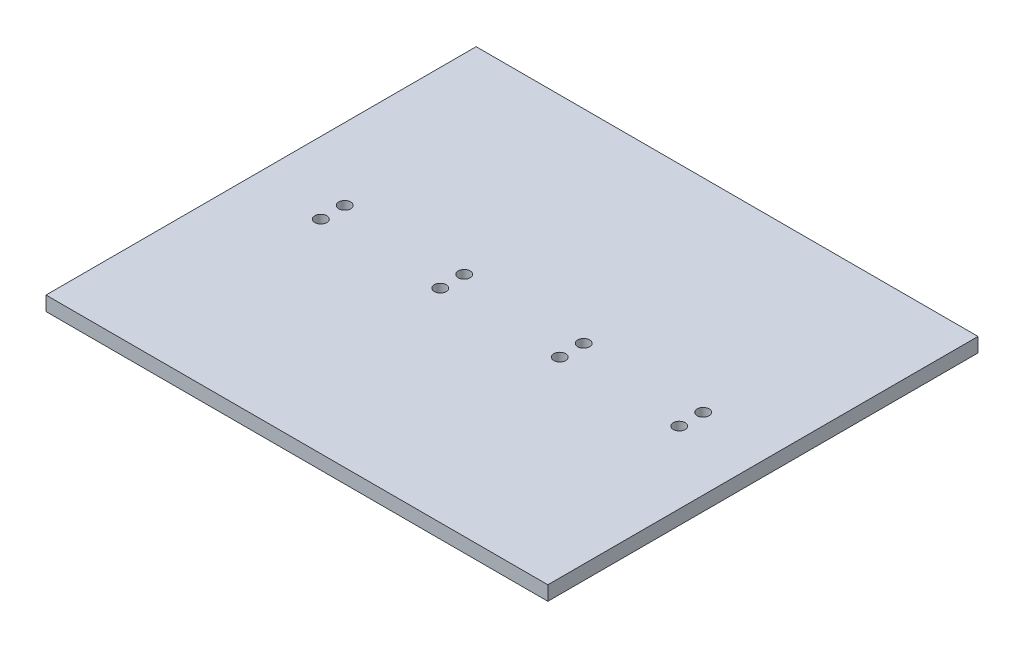
ISO-10303-21;
HEADER;
FILE_DESCRIPTION(('STEP AP214'),'2;1');
FILE_NAME('part.step','',(''),(''),'','','');
FILE_SCHEMA(('AUTOMOTIVE_DESIGN { 1 0 10303 214 1 1 1 1 }'));
ENDSEC;
DATA;
#1=APPLICATION_CONTEXT('core data for automotive mechanical design processes');
#2=APPLICATION_PROTOCOL_DEFINITION('international standard','automotive_design',2000,#1);
#3=PRODUCT_CONTEXT('',#1,'mechanical');
#4=PRODUCT('Part','Part','',(#3));
#5=PRODUCT_RELATED_PRODUCT_CATEGORY('part','',(#4));
#6=PRODUCT_DEFINITION_FORMATION('','',#4);
#7=PRODUCT_DEFINITION_CONTEXT('part definition',#1,'design');
#8=PRODUCT_DEFINITION('design','',#6,#7);
#9=PRODUCT_DEFINITION_SHAPE('','',#8);
#10=(LENGTH_UNIT() NAMED_UNIT(*) SI_UNIT(.MILLI.,.METRE.));
#11=(NAMED_UNIT(*) PLANE_ANGLE_UNIT() SI_UNIT($,.RADIAN.));
#12=(NAMED_UNIT(*) SI_UNIT($,.STERADIAN.) SOLID_ANGLE_UNIT());
#13=UNCERTAINTY_MEASURE_WITH_UNIT(LENGTH_MEASURE(1.E-05),#10,'distance_accuracy_value','');
#14=(GEOMETRIC_REPRESENTATION_CONTEXT(3) GLOBAL_UNCERTAINTY_ASSIGNED_CONTEXT((#13)) GLOBAL_UNIT_ASSIGNED_CONTEXT((#10,
#11,#12)) REPRESENTATION_CONTEXT('',''));
#15=CARTESIAN_POINT('',(0.,0.,0.));
#16=DIRECTION('',(0.,0.,1.));
#17=DIRECTION('',(1.,0.,0.));
#18=AXIS2_PLACEMENT_3D('',#15,#16,#17);
#19=CARTESIAN_POINT('',(5.25,0.3,4.5));
#20=DIRECTION('',(-1.,0.,0.));
#21=DIRECTION('',(0.,0.,1.));
#22=AXIS2_PLACEMENT_3D('',#19,#20,#21);
#23=PLANE('',#22);
#24=DIRECTION('',(0.,0.,-1.));
#25=VECTOR('',#24,1.);
#26=CARTESIAN_POINT('',(5.25,0.,4.5));
#27=LINE('',#26,#25);
#28=CARTESIAN_POINT('',(5.25,0.,4.5));
#29=VERTEX_POINT('',#28);
#30=CARTESIAN_POINT('',(5.25,0.,-4.5));
#31=VERTEX_POINT('',#30);
#32=EDGE_CURVE('E96',#29,#31,#27,.T.);
#33=ORIENTED_EDGE('',*,*,#32,.T.);
#34=DIRECTION('',(0.,-1.,0.));
#35=VECTOR('',#34,1.);
#36=CARTESIAN_POINT('',(5.25,0.3,-4.5));
#37=LINE('',#36,#35);
#38=CARTESIAN_POINT('',(5.25,0.3,-4.5));
#39=VERTEX_POINT('',#38);
#40=EDGE_CURVE('E11',#39,#31,#37,.T.);
#41=ORIENTED_EDGE('',*,*,#40,.F.);
#42=DIRECTION('',(0.,0.,-1.));
#43=VECTOR('',#42,1.);
#44=CARTESIAN_POINT('',(5.25,0.3,4.5));
#45=LINE('',#44,#43);
#46=CARTESIAN_POINT('',(5.25,0.3,4.5));
#47=VERTEX_POINT('',#46);
#48=EDGE_CURVE('E84',#47,#39,#45,.T.);
#49=ORIENTED_EDGE('',*,*,#48,.F.);
#50=DIRECTION('',(0.,-1.,0.));
#51=VECTOR('',#50,1.);
#52=CARTESIAN_POINT('',(5.25,0.3,4.5));
#53=LINE('',#52,#51);
#54=EDGE_CURVE('E92',#47,#29,#53,.T.);
#55=ORIENTED_EDGE('',*,*,#54,.T.);
#56=EDGE_LOOP('',(#33,#41,#49,#55));
#57=FACE_BOUND('',#56,.T.);
#58=ADVANCED_FACE('F33',(#57),#23,.F.);
#59=CARTESIAN_POINT('',(-5.25,0.3,-4.5));
#60=DIRECTION('',(0.,0.,1.));
#61=DIRECTION('',(1.,0.,0.));
#62=AXIS2_PLACEMENT_3D('',#59,#60,#61);
#63=PLANE('',#62);
#64=DIRECTION('',(-1.,0.,0.));
#65=VECTOR('',#64,1.);
#66=CARTESIAN_POINT('',(-5.25,0.,-4.5));
#67=LINE('',#66,#65);
#68=CARTESIAN_POINT('',(-5.25,0.,-4.5));
#69=VERTEX_POINT('',#68);
#70=EDGE_CURVE('E88',#31,#69,#67,.T.);
#71=ORIENTED_EDGE('',*,*,#70,.T.);
#72=DIRECTION('',(0.,-1.,0.));
#73=VECTOR('',#72,1.);
#74=CARTESIAN_POINT('',(-5.25,0.3,-4.5));
#75=LINE('',#74,#73);
#76=CARTESIAN_POINT('',(-5.25,0.3,-4.5));
#77=VERTEX_POINT('',#76);
#78=EDGE_CURVE('E41',#77,#69,#75,.T.);
#79=ORIENTED_EDGE('',*,*,#78,.F.);
#80=DIRECTION('',(-1.,0.,0.));
#81=VECTOR('',#80,1.);
#82=CARTESIAN_POINT('',(-5.25,0.3,-4.5));
#83=LINE('',#82,#81);
#84=EDGE_CURVE('E79',#39,#77,#83,.T.);
#85=ORIENTED_EDGE('',*,*,#84,.F.);
#86=ORIENTED_EDGE('',*,*,#40,.T.);
#87=EDGE_LOOP('',(#71,#79,#85,#86));
#88=FACE_BOUND('',#87,.T.);
#89=ADVANCED_FACE('F87',(#88),#63,.F.);
#90=CARTESIAN_POINT('',(-5.25,0.3,4.5));
#91=DIRECTION('',(1.,0.,0.));
#92=DIRECTION('',(0.,0.,-1.));
#93=AXIS2_PLACEMENT_3D('',#90,#91,#92);
#94=PLANE('',#93);
#95=DIRECTION('',(0.,0.,1.));
#96=VECTOR('',#95,1.);
#97=CARTESIAN_POINT('',(-5.25,0.,4.5));
#98=LINE('',#97,#96);
#99=CARTESIAN_POINT('',(-5.25,0.,4.5));
#100=VERTEX_POINT('',#99);
#101=EDGE_CURVE('E66',#69,#100,#98,.T.);
#102=ORIENTED_EDGE('',*,*,#101,.T.);
#103=DIRECTION('',(0.,-1.,0.));
#104=VECTOR('',#103,1.);
#105=CARTESIAN_POINT('',(-5.25,0.3,4.5));
#106=LINE('',#105,#104);
#107=CARTESIAN_POINT('',(-5.25,0.3,4.5));
#108=VERTEX_POINT('',#107);
#109=EDGE_CURVE('E89',#108,#100,#106,.T.);
#110=ORIENTED_EDGE('',*,*,#109,.F.);
#111=DIRECTION('',(0.,0.,1.));
#112=VECTOR('',#111,1.);
#113=CARTESIAN_POINT('',(-5.25,0.3,4.5));
#114=LINE('',#113,#112);
#115=EDGE_CURVE('E82',#77,#108,#114,.T.);
#116=ORIENTED_EDGE('',*,*,#115,.F.);
#117=ORIENTED_EDGE('',*,*,#78,.T.);
#118=EDGE_LOOP('',(#102,#110,#116,#117));
#119=FACE_BOUND('',#118,.T.);
#120=ADVANCED_FACE('F90',(#119),#94,.F.);
#121=CARTESIAN_POINT('',(-5.25,0.3,4.5));
#122=DIRECTION('',(0.,0.,-1.));
#123=DIRECTION('',(-1.,0.,0.));
#124=AXIS2_PLACEMENT_3D('',#121,#122,#123);
#125=PLANE('',#124);
#126=DIRECTION('',(1.,0.,0.));
#127=VECTOR('',#126,1.);
#128=CARTESIAN_POINT('',(-5.25,0.,4.5));
#129=LINE('',#128,#127);
#130=EDGE_CURVE('E72',#100,#29,#129,.T.);
#131=ORIENTED_EDGE('',*,*,#130,.T.);
#132=ORIENTED_EDGE('',*,*,#54,.F.);
#133=DIRECTION('',(1.,0.,0.));
#134=VECTOR('',#133,1.);
#135=CARTESIAN_POINT('',(-5.25,0.3,4.5));
#136=LINE('',#135,#134);
#137=EDGE_CURVE('E49',#108,#47,#136,.T.);
#138=ORIENTED_EDGE('',*,*,#137,.F.);
#139=ORIENTED_EDGE('',*,*,#109,.T.);
#140=EDGE_LOOP('',(#131,#132,#138,#139));
#141=FACE_BOUND('',#140,.T.);
#142=ADVANCED_FACE('F104',(#141),#125,.F.);
#143=CARTESIAN_POINT('',(0.,0.3,0.));
#144=DIRECTION('',(0.,-1.,0.));
#145=DIRECTION('',(0.,0.,-1.));
#146=AXIS2_PLACEMENT_3D('',#143,#144,#145);
#147=PLANE('',#146);
#148=CARTESIAN_POINT('',(-1.24999999999999,0.3,0.25));
#149=DIRECTION('',(0.,1.,0.));
#150=DIRECTION('',(0.,0.,1.));
#151=AXIS2_PLACEMENT_3D('',#148,#149,#150);
#152=CIRCLE('',#151,0.125);
#153=CARTESIAN_POINT('',(-1.24999999999999,0.3,0.375));
#154=VERTEX_POINT('',#153);
#155=EDGE_CURVE('E128',#154,#154,#152,.T.);
#156=ORIENTED_EDGE('',*,*,#155,.F.);
#157=EDGE_LOOP('',(#156));
#158=FACE_BOUND('',#157,.T.);
#159=CARTESIAN_POINT('',(3.75,0.3,-0.25));
#160=DIRECTION('',(0.,1.,0.));
#161=DIRECTION('',(0.,0.,1.));
#162=AXIS2_PLACEMENT_3D('',#159,#160,#161);
#163=CIRCLE('',#162,0.125000000000001);
#164=CARTESIAN_POINT('',(3.75,0.3,-0.124999999999999));
#165=VERTEX_POINT('',#164);
#166=EDGE_CURVE('E135',#165,#165,#163,.T.);
#167=ORIENTED_EDGE('',*,*,#166,.F.);
#168=EDGE_LOOP('',(#167));
#169=FACE_BOUND('',#168,.T.);
#170=CARTESIAN_POINT('',(1.25,0.3,-0.25));
#171=DIRECTION('',(0.,1.,0.));
#172=DIRECTION('',(0.,0.,1.));
#173=AXIS2_PLACEMENT_3D('',#170,#171,#172);
#174=CIRCLE('',#173,0.125000000000001);
#175=CARTESIAN_POINT('',(1.25,0.3,-0.124999999999999));
#176=VERTEX_POINT('',#175);
#177=EDGE_CURVE('E116',#176,#176,#174,.T.);
#178=ORIENTED_EDGE('',*,*,#177,.F.);
#179=EDGE_LOOP('',(#178));
#180=FACE_BOUND('',#179,.T.);
#181=CARTESIAN_POINT('',(-1.25,0.3,-0.25));
#182=DIRECTION('',(0.,1.,0.));
#183=DIRECTION('',(0.,0.,1.));
#184=AXIS2_PLACEMENT_3D('',#181,#182,#183);
#185=CIRCLE('',#184,0.125);
#186=CARTESIAN_POINT('',(-1.25,0.3,-0.125));
#187=VERTEX_POINT('',#186);
#188=EDGE_CURVE('E123',#187,#187,#185,.T.);
#189=ORIENTED_EDGE('',*,*,#188,.F.);
#190=EDGE_LOOP('',(#189));
#191=FACE_BOUND('',#190,.T.);
#192=CARTESIAN_POINT('',(1.25000000000001,0.3,0.25));
#193=DIRECTION('',(0.,1.,0.));
#194=DIRECTION('',(0.,0.,1.));
#195=AXIS2_PLACEMENT_3D('',#192,#193,#194);
#196=CIRCLE('',#195,0.125000000000001);
#197=CARTESIAN_POINT('',(1.25000000000001,0.3,0.375000000000001));
#198=VERTEX_POINT('',#197);
#199=EDGE_CURVE('E152',#198,#198,#196,.T.);
#200=ORIENTED_EDGE('',*,*,#199,.F.);
#201=EDGE_LOOP('',(#200));
#202=FACE_BOUND('',#201,.T.);
#203=CARTESIAN_POINT('',(3.75,0.3,0.25));
#204=DIRECTION('',(0.,1.,0.));
#205=DIRECTION('',(0.,0.,1.));
#206=AXIS2_PLACEMENT_3D('',#203,#204,#205);
#207=CIRCLE('',#206,0.125000000000001);
#208=CARTESIAN_POINT('',(3.75,0.3,0.375000000000001));
#209=VERTEX_POINT('',#208);
#210=EDGE_CURVE('E146',#209,#209,#207,.T.);
#211=ORIENTED_EDGE('',*,*,#210,.F.);
#212=EDGE_LOOP('',(#211));
#213=FACE_BOUND('',#212,.T.);
#214=CARTESIAN_POINT('',(-3.74999999999999,0.3,0.25));
#215=DIRECTION('',(0.,1.,0.));
#216=DIRECTION('',(0.,0.,1.));
#217=AXIS2_PLACEMENT_3D('',#214,#215,#216);
#218=CIRCLE('',#217,0.125);
#219=CARTESIAN_POINT('',(-3.74999999999999,0.3,0.375));
#220=VERTEX_POINT('',#219);
#221=EDGE_CURVE('E140',#220,#220,#218,.T.);
#222=ORIENTED_EDGE('',*,*,#221,.F.);
#223=EDGE_LOOP('',(#222));
#224=FACE_BOUND('',#223,.T.);
#225=CARTESIAN_POINT('',(-3.75,0.3,-0.25));
#226=DIRECTION('',(0.,1.,0.));
#227=DIRECTION('',(0.,0.,1.));
#228=AXIS2_PLACEMENT_3D('',#225,#226,#227);
#229=CIRCLE('',#228,0.125);
#230=CARTESIAN_POINT('',(-3.75,0.3,-0.125));
#231=VERTEX_POINT('',#230);
#232=EDGE_CURVE('E110',#231,#231,#229,.T.);
#233=ORIENTED_EDGE('',*,*,#232,.F.);
#234=EDGE_LOOP('',(#233));
#235=FACE_BOUND('',#234,.T.);
#236=ORIENTED_EDGE('',*,*,#48,.T.);
#237=ORIENTED_EDGE('',*,*,#84,.T.);
#238=ORIENTED_EDGE('',*,*,#115,.T.);
#239=ORIENTED_EDGE('',*,*,#137,.T.);
#240=EDGE_LOOP('',(#236,#237,#238,#239));
#241=FACE_BOUND('',#240,.T.);
#242=ADVANCED_FACE('F80',(#158,#169,#180,#191,#202,#213,#224,#235,#241),#147,.F.);
#243=CARTESIAN_POINT('',(0.,0.,0.));
#244=DIRECTION('',(0.,-1.,0.));
#245=DIRECTION('',(0.,0.,-1.));
#246=AXIS2_PLACEMENT_3D('',#243,#244,#245);
#247=PLANE('',#246);
#248=CARTESIAN_POINT('',(-1.24999999999999,0.,0.25));
#249=DIRECTION('',(0.,1.,0.));
#250=DIRECTION('',(0.,0.,1.));
#251=AXIS2_PLACEMENT_3D('',#248,#249,#250);
#252=CIRCLE('',#251,0.125);
#253=CARTESIAN_POINT('',(-1.24999999999999,0.,0.375));
#254=VERTEX_POINT('',#253);
#255=EDGE_CURVE('E131',#254,#254,#252,.T.);
#256=ORIENTED_EDGE('',*,*,#255,.T.);
#257=EDGE_LOOP('',(#256));
#258=FACE_BOUND('',#257,.T.);
#259=CARTESIAN_POINT('',(3.75,0.,-0.25));
#260=DIRECTION('',(0.,1.,0.));
#261=DIRECTION('',(0.,0.,1.));
#262=AXIS2_PLACEMENT_3D('',#259,#260,#261);
#263=CIRCLE('',#262,0.125000000000001);
#264=CARTESIAN_POINT('',(3.75,0.,-0.124999999999999));
#265=VERTEX_POINT('',#264);
#266=EDGE_CURVE('E120',#265,#265,#263,.T.);
#267=ORIENTED_EDGE('',*,*,#266,.T.);
#268=EDGE_LOOP('',(#267));
#269=FACE_BOUND('',#268,.T.);
#270=CARTESIAN_POINT('',(1.25,0.,-0.25));
#271=DIRECTION('',(0.,1.,0.));
#272=DIRECTION('',(0.,0.,1.));
#273=AXIS2_PLACEMENT_3D('',#270,#271,#272);
#274=CIRCLE('',#273,0.125000000000001);
#275=CARTESIAN_POINT('',(1.25,0.,-0.124999999999999));
#276=VERTEX_POINT('',#275);
#277=EDGE_CURVE('E119',#276,#276,#274,.T.);
#278=ORIENTED_EDGE('',*,*,#277,.T.);
#279=EDGE_LOOP('',(#278));
#280=FACE_BOUND('',#279,.T.);
#281=CARTESIAN_POINT('',(-1.25,0.,-0.25));
#282=DIRECTION('',(0.,1.,0.));
#283=DIRECTION('',(0.,0.,1.));
#284=AXIS2_PLACEMENT_3D('',#281,#282,#283);
#285=CIRCLE('',#284,0.125);
#286=CARTESIAN_POINT('',(-1.25,0.,-0.125));
#287=VERTEX_POINT('',#286);
#288=EDGE_CURVE('E113',#287,#287,#285,.T.);
#289=ORIENTED_EDGE('',*,*,#288,.T.);
#290=EDGE_LOOP('',(#289));
#291=FACE_BOUND('',#290,.T.);
#292=CARTESIAN_POINT('',(1.25000000000001,0.,0.25));
#293=DIRECTION('',(0.,1.,0.));
#294=DIRECTION('',(0.,0.,1.));
#295=AXIS2_PLACEMENT_3D('',#292,#293,#294);
#296=CIRCLE('',#295,0.125000000000001);
#297=CARTESIAN_POINT('',(1.25000000000001,0.,0.375000000000001));
#298=VERTEX_POINT('',#297);
#299=EDGE_CURVE('E132',#298,#298,#296,.T.);
#300=ORIENTED_EDGE('',*,*,#299,.T.);
#301=EDGE_LOOP('',(#300));
#302=FACE_BOUND('',#301,.T.);
#303=CARTESIAN_POINT('',(3.75,0.,0.25));
#304=DIRECTION('',(0.,1.,0.));
#305=DIRECTION('',(0.,0.,1.));
#306=AXIS2_PLACEMENT_3D('',#303,#304,#305);
#307=CIRCLE('',#306,0.125000000000001);
#308=CARTESIAN_POINT('',(3.75,0.,0.375000000000001));
#309=VERTEX_POINT('',#308);
#310=EDGE_CURVE('E149',#309,#309,#307,.T.);
#311=ORIENTED_EDGE('',*,*,#310,.T.);
#312=EDGE_LOOP('',(#311));
#313=FACE_BOUND('',#312,.T.);
#314=CARTESIAN_POINT('',(-3.74999999999999,0.,0.25));
#315=DIRECTION('',(0.,1.,0.));
#316=DIRECTION('',(0.,0.,1.));
#317=AXIS2_PLACEMENT_3D('',#314,#315,#316);
#318=CIRCLE('',#317,0.125);
#319=CARTESIAN_POINT('',(-3.74999999999999,0.,0.375));
#320=VERTEX_POINT('',#319);
#321=EDGE_CURVE('E143',#320,#320,#318,.T.);
#322=ORIENTED_EDGE('',*,*,#321,.T.);
#323=EDGE_LOOP('',(#322));
#324=FACE_BOUND('',#323,.T.);
#325=CARTESIAN_POINT('',(-3.75,0.,-0.25));
#326=DIRECTION('',(0.,1.,0.));
#327=DIRECTION('',(0.,0.,1.));
#328=AXIS2_PLACEMENT_3D('',#325,#326,#327);
#329=CIRCLE('',#328,0.125);
#330=CARTESIAN_POINT('',(-3.75,0.,-0.125));
#331=VERTEX_POINT('',#330);
#332=EDGE_CURVE('E99',#331,#331,#329,.T.);
#333=ORIENTED_EDGE('',*,*,#332,.T.);
#334=EDGE_LOOP('',(#333));
#335=FACE_BOUND('',#334,.T.);
#336=ORIENTED_EDGE('',*,*,#32,.F.);
#337=ORIENTED_EDGE('',*,*,#130,.F.);
#338=ORIENTED_EDGE('',*,*,#101,.F.);
#339=ORIENTED_EDGE('',*,*,#70,.F.);
#340=EDGE_LOOP('',(#336,#337,#338,#339));
#341=FACE_BOUND('',#340,.T.);
#342=ADVANCED_FACE('F107',(#258,#269,#280,#291,#302,#313,#324,#335,#341),#247,.T.);
#343=CARTESIAN_POINT('',(-3.75,0.,-0.25));
#344=DIRECTION('',(0.,1.,0.));
#345=DIRECTION('',(0.,0.,1.));
#346=AXIS2_PLACEMENT_3D('',#343,#344,#345);
#347=CYLINDRICAL_SURFACE('',#346,0.125);
#348=ORIENTED_EDGE('',*,*,#332,.F.);
#349=EDGE_LOOP('',(#348));
#350=FACE_BOUND('',#349,.T.);
#351=ORIENTED_EDGE('',*,*,#232,.T.);
#352=EDGE_LOOP('',(#351));
#353=FACE_BOUND('',#352,.T.);
#354=ADVANCED_FACE('F178',(#350,#353),#347,.F.);
#355=CARTESIAN_POINT('',(-3.74999999999999,0.,0.25));
#356=DIRECTION('',(0.,1.,0.));
#357=DIRECTION('',(0.,0.,1.));
#358=AXIS2_PLACEMENT_3D('',#355,#356,#357);
#359=CYLINDRICAL_SURFACE('',#358,0.125);
#360=ORIENTED_EDGE('',*,*,#321,.F.);
#361=EDGE_LOOP('',(#360));
#362=FACE_BOUND('',#361,.T.);
#363=ORIENTED_EDGE('',*,*,#221,.T.);
#364=EDGE_LOOP('',(#363));
#365=FACE_BOUND('',#364,.T.);
#366=ADVANCED_FACE('F180',(#362,#365),#359,.F.);
#367=CARTESIAN_POINT('',(3.75,0.,0.25));
#368=DIRECTION('',(0.,1.,0.));
#369=DIRECTION('',(0.,0.,1.));
#370=AXIS2_PLACEMENT_3D('',#367,#368,#369);
#371=CYLINDRICAL_SURFACE('',#370,0.125000000000001);
#372=ORIENTED_EDGE('',*,*,#310,.F.);
#373=EDGE_LOOP('',(#372));
#374=FACE_BOUND('',#373,.T.);
#375=ORIENTED_EDGE('',*,*,#210,.T.);
#376=EDGE_LOOP('',(#375));
#377=FACE_BOUND('',#376,.T.);
#378=ADVANCED_FACE('F164',(#374,#377),#371,.F.);
#379=CARTESIAN_POINT('',(1.25000000000001,0.,0.25));
#380=DIRECTION('',(0.,1.,0.));
#381=DIRECTION('',(0.,0.,1.));
#382=AXIS2_PLACEMENT_3D('',#379,#380,#381);
#383=CYLINDRICAL_SURFACE('',#382,0.125000000000001);
#384=ORIENTED_EDGE('',*,*,#299,.F.);
#385=EDGE_LOOP('',(#384));
#386=FACE_BOUND('',#385,.T.);
#387=ORIENTED_EDGE('',*,*,#199,.T.);
#388=EDGE_LOOP('',(#387));
#389=FACE_BOUND('',#388,.T.);
#390=ADVANCED_FACE('F160',(#386,#389),#383,.F.);
#391=CARTESIAN_POINT('',(-1.25,0.,-0.25));
#392=DIRECTION('',(0.,1.,0.));
#393=DIRECTION('',(0.,0.,1.));
#394=AXIS2_PLACEMENT_3D('',#391,#392,#393);
#395=CYLINDRICAL_SURFACE('',#394,0.125);
#396=ORIENTED_EDGE('',*,*,#288,.F.);
#397=EDGE_LOOP('',(#396));
#398=FACE_BOUND('',#397,.T.);
#399=ORIENTED_EDGE('',*,*,#188,.T.);
#400=EDGE_LOOP('',(#399));
#401=FACE_BOUND('',#400,.T.);
#402=ADVANCED_FACE('F163',(#398,#401),#395,.F.);
#403=CARTESIAN_POINT('',(1.25,0.,-0.25));
#404=DIRECTION('',(0.,1.,0.));
#405=DIRECTION('',(0.,0.,1.));
#406=AXIS2_PLACEMENT_3D('',#403,#404,#405);
#407=CYLINDRICAL_SURFACE('',#406,0.125000000000001);
#408=ORIENTED_EDGE('',*,*,#277,.F.);
#409=EDGE_LOOP('',(#408));
#410=FACE_BOUND('',#409,.T.);
#411=ORIENTED_EDGE('',*,*,#177,.T.);
#412=EDGE_LOOP('',(#411));
#413=FACE_BOUND('',#412,.T.);
#414=ADVANCED_FACE('F249',(#410,#413),#407,.F.);
#415=CARTESIAN_POINT('',(3.75,0.,-0.25));
#416=DIRECTION('',(0.,1.,0.));
#417=DIRECTION('',(0.,0.,1.));
#418=AXIS2_PLACEMENT_3D('',#415,#416,#417);
#419=CYLINDRICAL_SURFACE('',#418,0.125000000000001);
#420=ORIENTED_EDGE('',*,*,#266,.F.);
#421=EDGE_LOOP('',(#420));
#422=FACE_BOUND('',#421,.T.);
#423=ORIENTED_EDGE('',*,*,#166,.T.);
#424=EDGE_LOOP('',(#423));
#425=FACE_BOUND('',#424,.T.);
#426=ADVANCED_FACE('F259',(#422,#425),#419,.F.);
#427=CARTESIAN_POINT('',(-1.24999999999999,0.,0.25));
#428=DIRECTION('',(0.,1.,0.));
#429=DIRECTION('',(0.,0.,1.));
#430=AXIS2_PLACEMENT_3D('',#427,#428,#429);
#431=CYLINDRICAL_SURFACE('',#430,0.125);
#432=ORIENTED_EDGE('',*,*,#255,.F.);
#433=EDGE_LOOP('',(#432));
#434=FACE_BOUND('',#433,.T.);
#435=ORIENTED_EDGE('',*,*,#155,.T.);
#436=EDGE_LOOP('',(#435));
#437=FACE_BOUND('',#436,.T.);
#438=ADVANCED_FACE('F268',(#434,#437),#431,.F.);
#439=CLOSED_SHELL('',(#58,#89,#120,#142,#242,#342,#354,#366,#378,#390,#402,#414,#426,#438));
#440=MANIFOLD_SOLID_BREP('B2',#439);
#441=ADVANCED_BREP_SHAPE_REPRESENTATION('',(#18,#440),#14);
#442=SHAPE_DEFINITION_REPRESENTATION(#9,#441);
ENDSEC;
END-ISO-10303-21;
